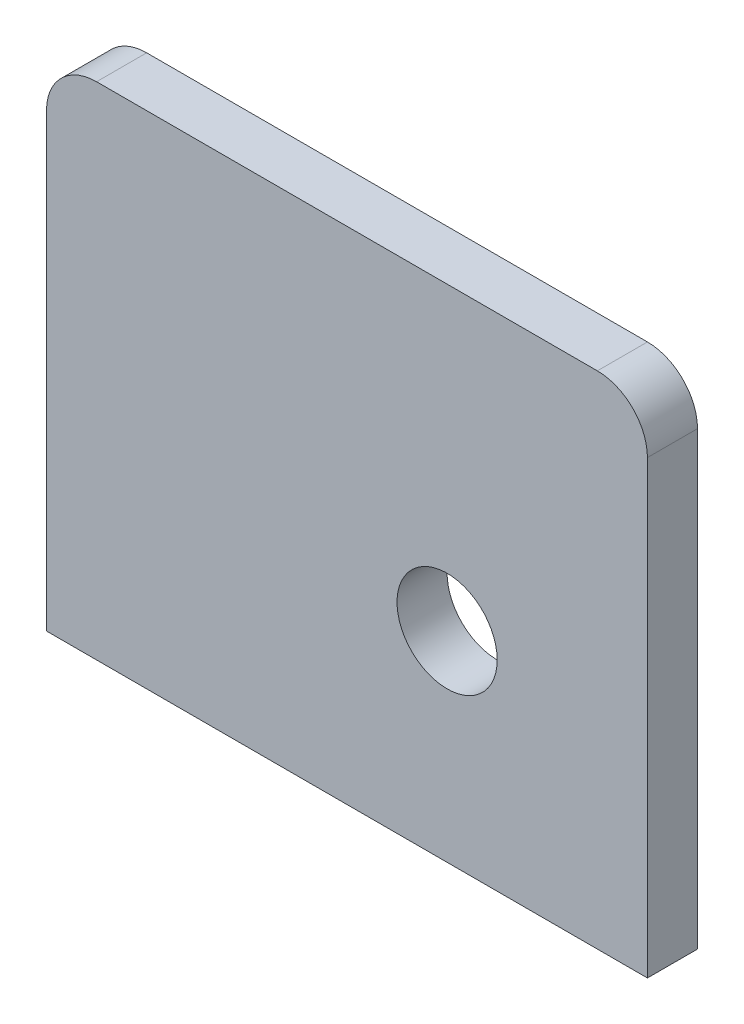
ISO-10303-21;
HEADER;
FILE_DESCRIPTION(('STEP AP214'),'2;1');
FILE_NAME('part.step','',(''),(''),'','','');
FILE_SCHEMA(('AUTOMOTIVE_DESIGN { 1 0 10303 214 1 1 1 1 }'));
ENDSEC;
DATA;
#1=APPLICATION_CONTEXT('core data for automotive mechanical design processes');
#2=APPLICATION_PROTOCOL_DEFINITION('international standard','automotive_design',2000,#1);
#3=PRODUCT_CONTEXT('',#1,'mechanical');
#4=PRODUCT('Part','Part','',(#3));
#5=PRODUCT_RELATED_PRODUCT_CATEGORY('part','',(#4));
#6=PRODUCT_DEFINITION_FORMATION('','',#4);
#7=PRODUCT_DEFINITION_CONTEXT('part definition',#1,'design');
#8=PRODUCT_DEFINITION('design','',#6,#7);
#9=PRODUCT_DEFINITION_SHAPE('','',#8);
#10=(LENGTH_UNIT() NAMED_UNIT(*) SI_UNIT(.MILLI.,.METRE.));
#11=(NAMED_UNIT(*) PLANE_ANGLE_UNIT() SI_UNIT($,.RADIAN.));
#12=(NAMED_UNIT(*) SI_UNIT($,.STERADIAN.) SOLID_ANGLE_UNIT());
#13=UNCERTAINTY_MEASURE_WITH_UNIT(LENGTH_MEASURE(1.E-05),#10,'distance_accuracy_value','');
#14=(GEOMETRIC_REPRESENTATION_CONTEXT(3) GLOBAL_UNCERTAINTY_ASSIGNED_CONTEXT((#13)) GLOBAL_UNIT_ASSIGNED_CONTEXT((#10,
#11,#12)) REPRESENTATION_CONTEXT('',''));
#15=CARTESIAN_POINT('',(0.,0.,0.));
#16=DIRECTION('',(0.,0.,1.));
#17=DIRECTION('',(1.,0.,0.));
#18=AXIS2_PLACEMENT_3D('',#15,#16,#17);
#19=CARTESIAN_POINT('',(0.,0.,6.35));
#20=DIRECTION('',(1.,0.,0.));
#21=DIRECTION('',(0.,0.,-1.));
#22=AXIS2_PLACEMENT_3D('',#19,#20,#21);
#23=PLANE('',#22);
#24=DIRECTION('',(0.,-1.,0.));
#25=VECTOR('',#24,1.);
#26=CARTESIAN_POINT('',(0.,0.,6.35));
#27=LINE('',#26,#25);
#28=CARTESIAN_POINT('',(0.,57.15,6.35));
#29=VERTEX_POINT('',#28);
#30=CARTESIAN_POINT('',(0.,0.,6.35));
#31=VERTEX_POINT('',#30);
#32=EDGE_CURVE('E86',#29,#31,#27,.T.);
#33=ORIENTED_EDGE('',*,*,#32,.F.);
#34=DIRECTION('',(0.,0.,-1.));
#35=VECTOR('',#34,1.);
#36=CARTESIAN_POINT('',(0.,57.15,6.35));
#37=LINE('',#36,#35);
#38=CARTESIAN_POINT('',(0.,57.15,0.));
#39=VERTEX_POINT('',#38);
#40=EDGE_CURVE('E110',#29,#39,#37,.T.);
#41=ORIENTED_EDGE('',*,*,#40,.T.);
#42=DIRECTION('',(0.,-1.,0.));
#43=VECTOR('',#42,1.);
#44=CARTESIAN_POINT('',(0.,0.,0.));
#45=LINE('',#44,#43);
#46=CARTESIAN_POINT('',(0.,0.,0.));
#47=VERTEX_POINT('',#46);
#48=EDGE_CURVE('E108',#39,#47,#45,.T.);
#49=ORIENTED_EDGE('',*,*,#48,.T.);
#50=DIRECTION('',(0.,0.,-1.));
#51=VECTOR('',#50,1.);
#52=CARTESIAN_POINT('',(0.,0.,6.35));
#53=LINE('',#52,#51);
#54=EDGE_CURVE('E102',#31,#47,#53,.T.);
#55=ORIENTED_EDGE('',*,*,#54,.F.);
#56=EDGE_LOOP('',(#33,#41,#49,#55));
#57=FACE_BOUND('',#56,.T.);
#58=ADVANCED_FACE('F34',(#57),#23,.F.);
#59=CARTESIAN_POINT('',(0.,0.,6.35));
#60=DIRECTION('',(0.,1.,0.));
#61=DIRECTION('',(0.,0.,1.));
#62=AXIS2_PLACEMENT_3D('',#59,#60,#61);
#63=PLANE('',#62);
#64=DIRECTION('',(1.,0.,0.));
#65=VECTOR('',#64,1.);
#66=CARTESIAN_POINT('',(0.,0.,0.));
#67=LINE('',#66,#65);
#68=CARTESIAN_POINT('',(76.2,0.,0.));
#69=VERTEX_POINT('',#68);
#70=EDGE_CURVE('E136',#47,#69,#67,.T.);
#71=ORIENTED_EDGE('',*,*,#70,.T.);
#72=DIRECTION('',(0.,0.,-1.));
#73=VECTOR('',#72,1.);
#74=CARTESIAN_POINT('',(76.2,0.,6.35));
#75=LINE('',#74,#73);
#76=CARTESIAN_POINT('',(76.2,0.,6.35));
#77=VERTEX_POINT('',#76);
#78=EDGE_CURVE('E104',#77,#69,#75,.T.);
#79=ORIENTED_EDGE('',*,*,#78,.F.);
#80=DIRECTION('',(1.,0.,0.));
#81=VECTOR('',#80,1.);
#82=CARTESIAN_POINT('',(0.,0.,6.35));
#83=LINE('',#82,#81);
#84=EDGE_CURVE('E89',#31,#77,#83,.T.);
#85=ORIENTED_EDGE('',*,*,#84,.F.);
#86=ORIENTED_EDGE('',*,*,#54,.T.);
#87=EDGE_LOOP('',(#71,#79,#85,#86));
#88=FACE_BOUND('',#87,.T.);
#89=ADVANCED_FACE('F101',(#88),#63,.F.);
#90=CARTESIAN_POINT('',(76.2,63.5,6.35));
#91=DIRECTION('',(-1.,0.,0.));
#92=DIRECTION('',(0.,-1.,0.));
#93=AXIS2_PLACEMENT_3D('',#90,#91,#92);
#94=PLANE('',#93);
#95=DIRECTION('',(0.,1.,0.));
#96=VECTOR('',#95,1.);
#97=CARTESIAN_POINT('',(76.2,63.5,0.));
#98=LINE('',#97,#96);
#99=CARTESIAN_POINT('',(76.2,57.15,0.));
#100=VERTEX_POINT('',#99);
#101=EDGE_CURVE('E135',#69,#100,#98,.T.);
#102=ORIENTED_EDGE('',*,*,#101,.T.);
#103=DIRECTION('',(0.,0.,-1.));
#104=VECTOR('',#103,1.);
#105=CARTESIAN_POINT('',(76.2,57.15,6.35));
#106=LINE('',#105,#104);
#107=CARTESIAN_POINT('',(76.2,57.15,6.35));
#108=VERTEX_POINT('',#107);
#109=EDGE_CURVE('E42',#100,#108,#106,.F.);
#110=ORIENTED_EDGE('',*,*,#109,.T.);
#111=DIRECTION('',(0.,1.,0.));
#112=VECTOR('',#111,1.);
#113=CARTESIAN_POINT('',(76.2,63.5,6.35));
#114=LINE('',#113,#112);
#115=EDGE_CURVE('E105',#77,#108,#114,.T.);
#116=ORIENTED_EDGE('',*,*,#115,.F.);
#117=ORIENTED_EDGE('',*,*,#78,.T.);
#118=EDGE_LOOP('',(#102,#110,#116,#117));
#119=FACE_BOUND('',#118,.T.);
#120=ADVANCED_FACE('F165',(#119),#94,.F.);
#121=CARTESIAN_POINT('',(0.,63.5,6.35));
#122=DIRECTION('',(0.,-1.,0.));
#123=DIRECTION('',(0.,0.,-1.));
#124=AXIS2_PLACEMENT_3D('',#121,#122,#123);
#125=PLANE('',#124);
#126=DIRECTION('',(-1.,0.,0.));
#127=VECTOR('',#126,1.);
#128=CARTESIAN_POINT('',(0.,63.5,6.35));
#129=LINE('',#128,#127);
#130=CARTESIAN_POINT('',(69.85,63.5,6.35));
#131=VERTEX_POINT('',#130);
#132=CARTESIAN_POINT('',(6.35,63.5,6.35));
#133=VERTEX_POINT('',#132);
#134=EDGE_CURVE('E114',#131,#133,#129,.T.);
#135=ORIENTED_EDGE('',*,*,#134,.F.);
#136=DIRECTION('',(0.,0.,-1.));
#137=VECTOR('',#136,1.);
#138=CARTESIAN_POINT('',(69.85,63.5,6.35));
#139=LINE('',#138,#137);
#140=CARTESIAN_POINT('',(69.85,63.5,0.));
#141=VERTEX_POINT('',#140);
#142=EDGE_CURVE('E124',#131,#141,#139,.T.);
#143=ORIENTED_EDGE('',*,*,#142,.T.);
#144=DIRECTION('',(-1.,0.,0.));
#145=VECTOR('',#144,1.);
#146=CARTESIAN_POINT('',(0.,63.5,0.));
#147=LINE('',#146,#145);
#148=CARTESIAN_POINT('',(6.35,63.5,0.));
#149=VERTEX_POINT('',#148);
#150=EDGE_CURVE('E97',#141,#149,#147,.T.);
#151=ORIENTED_EDGE('',*,*,#150,.T.);
#152=DIRECTION('',(0.,0.,-1.));
#153=VECTOR('',#152,1.);
#154=CARTESIAN_POINT('',(6.35,63.5,6.35));
#155=LINE('',#154,#153);
#156=EDGE_CURVE('E120',#149,#133,#155,.F.);
#157=ORIENTED_EDGE('',*,*,#156,.T.);
#158=EDGE_LOOP('',(#135,#143,#151,#157));
#159=FACE_BOUND('',#158,.T.);
#160=ADVANCED_FACE('F130',(#159),#125,.F.);
#161=CARTESIAN_POINT('',(0.,0.,6.35));
#162=DIRECTION('',(0.,0.,-1.));
#163=DIRECTION('',(-1.,0.,0.));
#164=AXIS2_PLACEMENT_3D('',#161,#162,#163);
#165=PLANE('',#164);
#166=CARTESIAN_POINT('',(50.8,25.4,6.35));
#167=DIRECTION('',(0.,0.,1.));
#168=DIRECTION('',(1.,0.,0.));
#169=AXIS2_PLACEMENT_3D('',#166,#167,#168);
#170=CIRCLE('',#169,6.35);
#171=CARTESIAN_POINT('',(57.15,25.4,6.35));
#172=VERTEX_POINT('',#171);
#173=EDGE_CURVE('E144',#172,#172,#170,.T.);
#174=ORIENTED_EDGE('',*,*,#173,.F.);
#175=EDGE_LOOP('',(#174));
#176=FACE_BOUND('',#175,.T.);
#177=ORIENTED_EDGE('',*,*,#115,.T.);
#178=CARTESIAN_POINT('',(69.85,57.15,6.35));
#179=DIRECTION('',(0.,0.,-1.));
#180=DIRECTION('',(-1.,0.,0.));
#181=AXIS2_PLACEMENT_3D('',#178,#179,#180);
#182=CIRCLE('',#181,6.35);
#183=EDGE_CURVE('E11',#108,#131,#182,.F.);
#184=ORIENTED_EDGE('',*,*,#183,.T.);
#185=ORIENTED_EDGE('',*,*,#134,.T.);
#186=CARTESIAN_POINT('',(6.35,57.15,6.35));
#187=DIRECTION('',(0.,0.,-1.));
#188=DIRECTION('',(-1.,0.,0.));
#189=AXIS2_PLACEMENT_3D('',#186,#187,#188);
#190=CIRCLE('',#189,6.35);
#191=EDGE_CURVE('E92',#133,#29,#190,.F.);
#192=ORIENTED_EDGE('',*,*,#191,.T.);
#193=ORIENTED_EDGE('',*,*,#32,.T.);
#194=ORIENTED_EDGE('',*,*,#84,.T.);
#195=EDGE_LOOP('',(#177,#184,#185,#192,#193,#194));
#196=FACE_BOUND('',#195,.T.);
#197=ADVANCED_FACE('F88',(#176,#196),#165,.F.);
#198=CARTESIAN_POINT('',(0.,0.,0.));
#199=DIRECTION('',(0.,0.,-1.));
#200=DIRECTION('',(-1.,0.,0.));
#201=AXIS2_PLACEMENT_3D('',#198,#199,#200);
#202=PLANE('',#201);
#203=CARTESIAN_POINT('',(50.8,25.4,0.));
#204=DIRECTION('',(0.,0.,1.));
#205=DIRECTION('',(1.,0.,0.));
#206=AXIS2_PLACEMENT_3D('',#203,#204,#205);
#207=CIRCLE('',#206,6.35);
#208=CARTESIAN_POINT('',(57.15,25.4,0.));
#209=VERTEX_POINT('',#208);
#210=EDGE_CURVE('E141',#209,#209,#207,.T.);
#211=ORIENTED_EDGE('',*,*,#210,.T.);
#212=EDGE_LOOP('',(#211));
#213=FACE_BOUND('',#212,.T.);
#214=ORIENTED_EDGE('',*,*,#150,.F.);
#215=CARTESIAN_POINT('',(69.85,57.15,0.));
#216=DIRECTION('',(0.,0.,-1.));
#217=DIRECTION('',(-1.,0.,0.));
#218=AXIS2_PLACEMENT_3D('',#215,#216,#217);
#219=CIRCLE('',#218,6.35);
#220=EDGE_CURVE('E56',#141,#100,#219,.T.);
#221=ORIENTED_EDGE('',*,*,#220,.T.);
#222=ORIENTED_EDGE('',*,*,#101,.F.);
#223=ORIENTED_EDGE('',*,*,#70,.F.);
#224=ORIENTED_EDGE('',*,*,#48,.F.);
#225=CARTESIAN_POINT('',(6.35,57.15,0.));
#226=DIRECTION('',(0.,0.,-1.));
#227=DIRECTION('',(-1.,0.,0.));
#228=AXIS2_PLACEMENT_3D('',#225,#226,#227);
#229=CIRCLE('',#228,6.35);
#230=EDGE_CURVE('E112',#39,#149,#229,.T.);
#231=ORIENTED_EDGE('',*,*,#230,.T.);
#232=EDGE_LOOP('',(#214,#221,#222,#223,#224,#231));
#233=FACE_BOUND('',#232,.T.);
#234=ADVANCED_FACE('F133',(#213,#233),#202,.T.);
#235=CARTESIAN_POINT('',(6.35,57.15,6.35));
#236=DIRECTION('',(0.,0.,-1.));
#237=DIRECTION('',(-1.,0.,0.));
#238=AXIS2_PLACEMENT_3D('',#235,#236,#237);
#239=CYLINDRICAL_SURFACE('',#238,6.35);
#240=ORIENTED_EDGE('',*,*,#191,.F.);
#241=ORIENTED_EDGE('',*,*,#156,.F.);
#242=ORIENTED_EDGE('',*,*,#230,.F.);
#243=ORIENTED_EDGE('',*,*,#40,.F.);
#244=EDGE_LOOP('',(#240,#241,#242,#243));
#245=FACE_BOUND('',#244,.T.);
#246=ADVANCED_FACE('F163',(#245),#239,.T.);
#247=CARTESIAN_POINT('',(69.85,57.15,6.35));
#248=DIRECTION('',(0.,0.,-1.));
#249=DIRECTION('',(-1.,0.,0.));
#250=AXIS2_PLACEMENT_3D('',#247,#248,#249);
#251=CYLINDRICAL_SURFACE('',#250,6.35);
#252=ORIENTED_EDGE('',*,*,#183,.F.);
#253=ORIENTED_EDGE('',*,*,#109,.F.);
#254=ORIENTED_EDGE('',*,*,#220,.F.);
#255=ORIENTED_EDGE('',*,*,#142,.F.);
#256=EDGE_LOOP('',(#252,#253,#254,#255));
#257=FACE_BOUND('',#256,.T.);
#258=ADVANCED_FACE('F36',(#257),#251,.T.);
#259=CARTESIAN_POINT('',(50.8,25.4,0.));
#260=DIRECTION('',(0.,0.,1.));
#261=DIRECTION('',(1.,0.,0.));
#262=AXIS2_PLACEMENT_3D('',#259,#260,#261);
#263=CYLINDRICAL_SURFACE('',#262,6.35);
#264=ORIENTED_EDGE('',*,*,#210,.F.);
#265=EDGE_LOOP('',(#264));
#266=FACE_BOUND('',#265,.T.);
#267=ORIENTED_EDGE('',*,*,#173,.T.);
#268=EDGE_LOOP('',(#267));
#269=FACE_BOUND('',#268,.T.);
#270=ADVANCED_FACE('F151',(#266,#269),#263,.F.);
#271=CLOSED_SHELL('',(#58,#89,#120,#160,#197,#234,#246,#258,#270));
#272=MANIFOLD_SOLID_BREP('B2',#271);
#273=ADVANCED_BREP_SHAPE_REPRESENTATION('',(#18,#272),#14);
#274=SHAPE_DEFINITION_REPRESENTATION(#9,#273);
ENDSEC;
END-ISO-10303-21;
